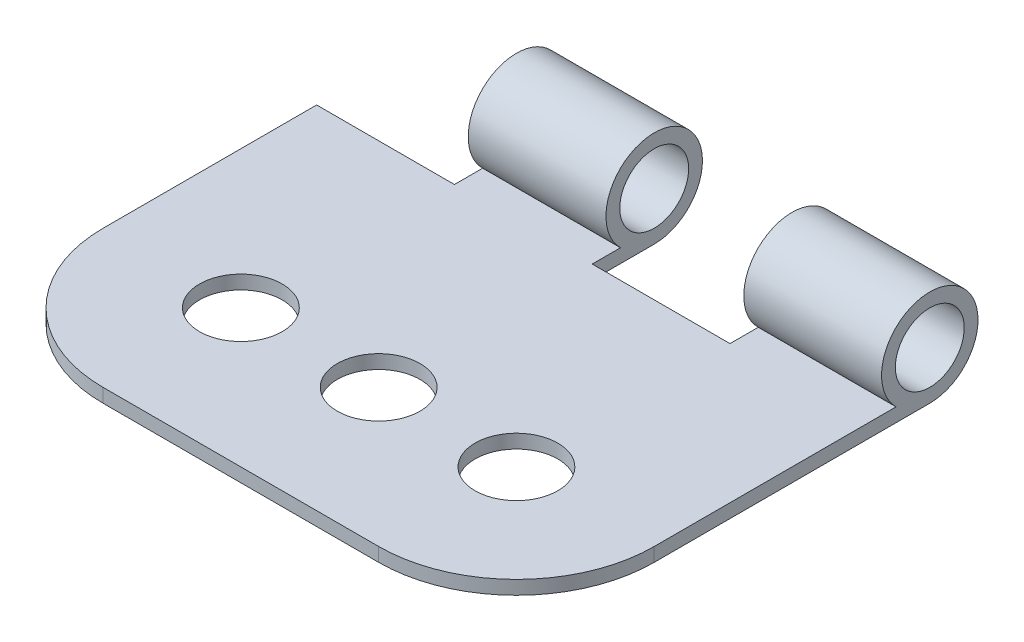
ISO-10303-21;
HEADER;
FILE_DESCRIPTION(('STEP AP214'),'2;1');
FILE_NAME('part.step','',(''),(''),'','','');
FILE_SCHEMA(('AUTOMOTIVE_DESIGN { 1 0 10303 214 1 1 1 1 }'));
ENDSEC;
DATA;
#1=APPLICATION_CONTEXT('core data for automotive mechanical design processes');
#2=APPLICATION_PROTOCOL_DEFINITION('international standard','automotive_design',2000,#1);
#3=PRODUCT_CONTEXT('',#1,'mechanical');
#4=PRODUCT('Part','Part','',(#3));
#5=PRODUCT_RELATED_PRODUCT_CATEGORY('part','',(#4));
#6=PRODUCT_DEFINITION_FORMATION('','',#4);
#7=PRODUCT_DEFINITION_CONTEXT('part definition',#1,'design');
#8=PRODUCT_DEFINITION('design','',#6,#7);
#9=PRODUCT_DEFINITION_SHAPE('','',#8);
#10=(LENGTH_UNIT() NAMED_UNIT(*) SI_UNIT(.MILLI.,.METRE.));
#11=(NAMED_UNIT(*) PLANE_ANGLE_UNIT() SI_UNIT($,.RADIAN.));
#12=(NAMED_UNIT(*) SI_UNIT($,.STERADIAN.) SOLID_ANGLE_UNIT());
#13=UNCERTAINTY_MEASURE_WITH_UNIT(LENGTH_MEASURE(1.E-05),#10,'distance_accuracy_value','');
#14=(GEOMETRIC_REPRESENTATION_CONTEXT(3) GLOBAL_UNCERTAINTY_ASSIGNED_CONTEXT((#13)) GLOBAL_UNIT_ASSIGNED_CONTEXT((#10,
#11,#12)) REPRESENTATION_CONTEXT('',''));
#15=CARTESIAN_POINT('',(0.,0.,0.));
#16=DIRECTION('',(0.,0.,1.));
#17=DIRECTION('',(1.,0.,0.));
#18=AXIS2_PLACEMENT_3D('',#15,#16,#17);
#19=CARTESIAN_POINT('',(40.,-0.342276542958337,17.6196220545612));
#20=DIRECTION('',(1.,0.,0.));
#21=DIRECTION('',(0.,0.,-1.));
#22=AXIS2_PLACEMENT_3D('',#19,#20,#21);
#23=PLANE('',#22);
#24=CARTESIAN_POINT('',(40.,-0.342276542958337,17.6196220545612));
#25=DIRECTION('',(1.,0.,0.));
#26=DIRECTION('',(0.,0.,-1.));
#27=AXIS2_PLACEMENT_3D('',#24,#25,#26);
#28=CIRCLE('',#27,2.5);
#29=CARTESIAN_POINT('',(40.,-0.342276542958337,15.1196220545612));
#30=VERTEX_POINT('',#29);
#31=EDGE_CURVE('E148',#30,#30,#28,.T.);
#32=ORIENTED_EDGE('',*,*,#31,.F.);
#33=EDGE_LOOP('',(#32));
#34=FACE_BOUND('',#33,.T.);
#35=DIRECTION('',(0.,0.,1.));
#36=VECTOR('',#35,1.);
#37=CARTESIAN_POINT('',(40.,-2.84227654295834,57.6196220545612));
#38=LINE('',#37,#36);
#39=CARTESIAN_POINT('',(40.,-2.84227654295833,20.0691117973444));
#40=VERTEX_POINT('',#39);
#41=CARTESIAN_POINT('',(40.,-2.84227654295834,37.6196220545612));
#42=VERTEX_POINT('',#41);
#43=EDGE_CURVE('E135',#40,#42,#38,.T.);
#44=ORIENTED_EDGE('',*,*,#43,.T.);
#45=DIRECTION('',(0.,1.,0.));
#46=VECTOR('',#45,1.);
#47=CARTESIAN_POINT('',(40.,-3.84227654295834,37.6196220545612));
#48=LINE('',#47,#46);
#49=CARTESIAN_POINT('',(40.,-3.84227654295834,37.6196220545612));
#50=VERTEX_POINT('',#49);
#51=EDGE_CURVE('E48',#50,#42,#48,.T.);
#52=ORIENTED_EDGE('',*,*,#51,.F.);
#53=DIRECTION('',(0.,0.,-1.));
#54=VECTOR('',#53,1.);
#55=CARTESIAN_POINT('',(40.,-3.84227654295834,57.6196220545612));
#56=LINE('',#55,#54);
#57=CARTESIAN_POINT('',(40.,-3.84227654295834,17.6196220545612));
#58=VERTEX_POINT('',#57);
#59=EDGE_CURVE('E132',#50,#58,#56,.T.);
#60=ORIENTED_EDGE('',*,*,#59,.T.);
#61=CARTESIAN_POINT('',(40.,-0.342276542958337,17.6196220545612));
#62=DIRECTION('',(1.,0.,0.));
#63=DIRECTION('',(0.,0.,-1.));
#64=AXIS2_PLACEMENT_3D('',#61,#62,#63);
#65=CIRCLE('',#64,3.5);
#66=EDGE_CURVE('E56',#58,#40,#65,.T.);
#67=ORIENTED_EDGE('',*,*,#66,.T.);
#68=EDGE_LOOP('',(#44,#52,#60,#67));
#69=FACE_BOUND('',#68,.T.);
#70=ADVANCED_FACE('F33',(#34,#69),#23,.T.);
#71=CARTESIAN_POINT('',(0.,-0.342276542958337,17.6196220545612));
#72=DIRECTION('',(1.,0.,0.));
#73=DIRECTION('',(0.,0.,-1.));
#74=AXIS2_PLACEMENT_3D('',#71,#72,#73);
#75=PLANE('',#74);
#76=DIRECTION('',(0.,1.,0.));
#77=VECTOR('',#76,1.);
#78=CARTESIAN_POINT('',(0.,-3.84227654295834,37.6196220545612));
#79=LINE('',#78,#77);
#80=CARTESIAN_POINT('',(0.,-3.84227654295834,37.6196220545612));
#81=VERTEX_POINT('',#80);
#82=CARTESIAN_POINT('',(0.,-2.84227654295834,37.6196220545612));
#83=VERTEX_POINT('',#82);
#84=EDGE_CURVE('E221',#81,#83,#79,.T.);
#85=ORIENTED_EDGE('',*,*,#84,.T.);
#86=DIRECTION('',(0.,0.,1.));
#87=VECTOR('',#86,1.);
#88=CARTESIAN_POINT('',(0.,-2.84227654295834,57.6196220545612));
#89=LINE('',#88,#87);
#90=CARTESIAN_POINT('',(0.,-2.84227654295834,22.1196220545612));
#91=VERTEX_POINT('',#90);
#92=EDGE_CURVE('E141',#91,#83,#89,.T.);
#93=ORIENTED_EDGE('',*,*,#92,.F.);
#94=DIRECTION('',(0.,1.,0.));
#95=VECTOR('',#94,1.);
#96=CARTESIAN_POINT('',(0.,-42.8422765429583,22.1196220545612));
#97=LINE('',#96,#95);
#98=CARTESIAN_POINT('',(0.,-3.84227654295834,22.1196220545612));
#99=VERTEX_POINT('',#98);
#100=EDGE_CURVE('E194',#99,#91,#97,.T.);
#101=ORIENTED_EDGE('',*,*,#100,.F.);
#102=DIRECTION('',(0.,0.,-1.));
#103=VECTOR('',#102,1.);
#104=CARTESIAN_POINT('',(0.,-3.84227654295834,57.6196220545612));
#105=LINE('',#104,#103);
#106=EDGE_CURVE('E145',#81,#99,#105,.T.);
#107=ORIENTED_EDGE('',*,*,#106,.F.);
#108=EDGE_LOOP('',(#85,#93,#101,#107));
#109=FACE_BOUND('',#108,.T.);
#110=ADVANCED_FACE('F280',(#109),#75,.F.);
#111=CARTESIAN_POINT('',(40.,-0.342276542958337,17.6196220545612));
#112=DIRECTION('',(-1.,0.,0.));
#113=DIRECTION('',(0.,0.,1.));
#114=AXIS2_PLACEMENT_3D('',#111,#112,#113);
#115=CYLINDRICAL_SURFACE('',#114,3.5);
#116=CARTESIAN_POINT('',(20.,-0.342276542958337,17.6196220545612));
#117=DIRECTION('',(-1.,0.,0.));
#118=DIRECTION('',(0.,0.,1.));
#119=AXIS2_PLACEMENT_3D('',#116,#117,#118);
#120=CIRCLE('',#119,3.5);
#121=CARTESIAN_POINT('',(20.,-2.84227654295833,20.0691117973444));
#122=VERTEX_POINT('',#121);
#123=CARTESIAN_POINT('',(20.,-3.84227654295834,17.6196220545612));
#124=VERTEX_POINT('',#123);
#125=EDGE_CURVE('E178',#122,#124,#120,.T.);
#126=ORIENTED_EDGE('',*,*,#125,.T.);
#127=DIRECTION('',(-1.,0.,0.));
#128=VECTOR('',#127,1.);
#129=CARTESIAN_POINT('',(40.,-3.84227654295834,17.6196220545612));
#130=LINE('',#129,#128);
#131=CARTESIAN_POINT('',(10.,-3.84227654295834,17.6196220545612));
#132=VERTEX_POINT('',#131);
#133=EDGE_CURVE('E157',#124,#132,#130,.T.);
#134=ORIENTED_EDGE('',*,*,#133,.T.);
#135=CARTESIAN_POINT('',(10.,-0.342276542958337,17.6196220545612));
#136=DIRECTION('',(1.,0.,0.));
#137=DIRECTION('',(0.,0.,-1.));
#138=AXIS2_PLACEMENT_3D('',#135,#136,#137);
#139=CIRCLE('',#138,3.5);
#140=CARTESIAN_POINT('',(10.,-2.84227654295834,20.0691117973444));
#141=VERTEX_POINT('',#140);
#142=EDGE_CURVE('E176',#132,#141,#139,.T.);
#143=ORIENTED_EDGE('',*,*,#142,.T.);
#144=DIRECTION('',(-1.,0.,0.));
#145=VECTOR('',#144,1.);
#146=CARTESIAN_POINT('',(40.,-2.84227654295833,20.0691117973444));
#147=LINE('',#146,#145);
#148=EDGE_CURVE('E152',#122,#141,#147,.T.);
#149=ORIENTED_EDGE('',*,*,#148,.F.);
#150=EDGE_LOOP('',(#126,#134,#143,#149));
#151=FACE_BOUND('',#150,.T.);
#152=ADVANCED_FACE('F302',(#151),#115,.T.);
#153=CARTESIAN_POINT('',(40.,-0.342276542958337,17.6196220545612));
#154=DIRECTION('',(-1.,0.,0.));
#155=DIRECTION('',(0.,0.,1.));
#156=AXIS2_PLACEMENT_3D('',#153,#154,#155);
#157=CYLINDRICAL_SURFACE('',#156,2.5);
#158=CARTESIAN_POINT('',(20.,-0.342276542958337,17.6196220545612));
#159=DIRECTION('',(-1.,0.,0.));
#160=DIRECTION('',(0.,0.,1.));
#161=AXIS2_PLACEMENT_3D('',#158,#159,#160);
#162=CIRCLE('',#161,2.5);
#163=CARTESIAN_POINT('',(20.,-0.342276542958337,20.1196220545612));
#164=VERTEX_POINT('',#163);
#165=EDGE_CURVE('E11',#164,#164,#162,.T.);
#166=ORIENTED_EDGE('',*,*,#165,.F.);
#167=EDGE_LOOP('',(#166));
#168=FACE_BOUND('',#167,.T.);
#169=CARTESIAN_POINT('',(10.,-0.342276542958337,17.6196220545612));
#170=DIRECTION('',(1.,0.,0.));
#171=DIRECTION('',(0.,0.,-1.));
#172=AXIS2_PLACEMENT_3D('',#169,#170,#171);
#173=CIRCLE('',#172,2.5);
#174=CARTESIAN_POINT('',(10.,-0.342276542958337,15.1196220545612));
#175=VERTEX_POINT('',#174);
#176=EDGE_CURVE('E159',#175,#175,#173,.T.);
#177=ORIENTED_EDGE('',*,*,#176,.F.);
#178=EDGE_LOOP('',(#177));
#179=FACE_BOUND('',#178,.T.);
#180=ADVANCED_FACE('F172',(#168,#179),#157,.F.);
#181=CARTESIAN_POINT('',(40.,-3.84227654295834,57.6196220545612));
#182=DIRECTION('',(0.,1.,0.));
#183=DIRECTION('',(0.,0.,1.));
#184=AXIS2_PLACEMENT_3D('',#181,#182,#183);
#185=PLANE('',#184);
#186=CARTESIAN_POINT('',(30.,-3.84227654295834,37.6196220545612));
#187=DIRECTION('',(0.,1.,0.));
#188=DIRECTION('',(0.,0.,1.));
#189=AXIS2_PLACEMENT_3D('',#186,#187,#188);
#190=CIRCLE('',#189,3.);
#191=CARTESIAN_POINT('',(30.,-3.84227654295834,40.6196220545612));
#192=VERTEX_POINT('',#191);
#193=EDGE_CURVE('E247',#192,#192,#190,.T.);
#194=ORIENTED_EDGE('',*,*,#193,.T.);
#195=EDGE_LOOP('',(#194));
#196=FACE_BOUND('',#195,.T.);
#197=CARTESIAN_POINT('',(20.,-3.84227654295834,37.6196220545612));
#198=DIRECTION('',(0.,1.,0.));
#199=DIRECTION('',(0.,0.,1.));
#200=AXIS2_PLACEMENT_3D('',#197,#198,#199);
#201=CIRCLE('',#200,3.);
#202=CARTESIAN_POINT('',(20.,-3.84227654295834,40.6196220545612));
#203=VERTEX_POINT('',#202);
#204=EDGE_CURVE('E241',#203,#203,#201,.T.);
#205=ORIENTED_EDGE('',*,*,#204,.T.);
#206=EDGE_LOOP('',(#205));
#207=FACE_BOUND('',#206,.T.);
#208=CARTESIAN_POINT('',(10.,-3.84227654295834,37.6196220545612));
#209=DIRECTION('',(0.,1.,0.));
#210=DIRECTION('',(0.,0.,1.));
#211=AXIS2_PLACEMENT_3D('',#208,#209,#210);
#212=CIRCLE('',#211,3.);
#213=CARTESIAN_POINT('',(10.,-3.84227654295834,40.6196220545612));
#214=VERTEX_POINT('',#213);
#215=EDGE_CURVE('E234',#214,#214,#212,.T.);
#216=ORIENTED_EDGE('',*,*,#215,.T.);
#217=EDGE_LOOP('',(#216));
#218=FACE_BOUND('',#217,.T.);
#219=DIRECTION('',(-1.,0.,0.));
#220=VECTOR('',#219,1.);
#221=CARTESIAN_POINT('',(10.,-3.84227654295834,47.6196220545612));
#222=LINE('',#221,#220);
#223=CARTESIAN_POINT('',(30.,-3.84227654295834,47.6196220545612));
#224=VERTEX_POINT('',#223);
#225=CARTESIAN_POINT('',(10.,-3.84227654295834,47.6196220545612));
#226=VERTEX_POINT('',#225);
#227=EDGE_CURVE('E129',#224,#226,#222,.T.);
#228=ORIENTED_EDGE('',*,*,#227,.T.);
#229=CARTESIAN_POINT('',(10.,-3.84227654295834,37.6196220545612));
#230=DIRECTION('',(0.,-1.,0.));
#231=DIRECTION('',(0.,0.,1.));
#232=AXIS2_PLACEMENT_3D('',#229,#230,#231);
#233=CIRCLE('',#232,10.);
#234=EDGE_CURVE('E136',#226,#81,#233,.T.);
#235=ORIENTED_EDGE('',*,*,#234,.T.);
#236=ORIENTED_EDGE('',*,*,#106,.T.);
#237=DIRECTION('',(1.,0.,0.));
#238=VECTOR('',#237,1.);
#239=CARTESIAN_POINT('',(40.,-3.84227654295834,22.1196220545612));
#240=LINE('',#239,#238);
#241=CARTESIAN_POINT('',(10.,-3.84227654295834,22.1196220545612));
#242=VERTEX_POINT('',#241);
#243=EDGE_CURVE('E190',#99,#242,#240,.T.);
#244=ORIENTED_EDGE('',*,*,#243,.T.);
#245=DIRECTION('',(0.,0.,-1.));
#246=VECTOR('',#245,1.);
#247=CARTESIAN_POINT('',(10.,-3.84227654295834,57.6196220545612));
#248=LINE('',#247,#246);
#249=EDGE_CURVE('E187',#242,#132,#248,.T.);
#250=ORIENTED_EDGE('',*,*,#249,.T.);
#251=ORIENTED_EDGE('',*,*,#133,.F.);
#252=DIRECTION('',(0.,0.,1.));
#253=VECTOR('',#252,1.);
#254=CARTESIAN_POINT('',(20.,-3.84227654295834,57.6196220545612));
#255=LINE('',#254,#253);
#256=CARTESIAN_POINT('',(20.,-3.84227654295834,22.1196220545612));
#257=VERTEX_POINT('',#256);
#258=EDGE_CURVE('E205',#124,#257,#255,.T.);
#259=ORIENTED_EDGE('',*,*,#258,.T.);
#260=DIRECTION('',(1.,0.,0.));
#261=VECTOR('',#260,1.);
#262=CARTESIAN_POINT('',(40.,-3.84227654295834,22.1196220545612));
#263=LINE('',#262,#261);
#264=CARTESIAN_POINT('',(30.,-3.84227654295834,22.1196220545612));
#265=VERTEX_POINT('',#264);
#266=EDGE_CURVE('E202',#257,#265,#263,.T.);
#267=ORIENTED_EDGE('',*,*,#266,.T.);
#268=DIRECTION('',(0.,0.,-1.));
#269=VECTOR('',#268,1.);
#270=CARTESIAN_POINT('',(30.,-3.84227654295834,57.6196220545612));
#271=LINE('',#270,#269);
#272=CARTESIAN_POINT('',(30.,-3.84227654295834,17.6196220545612));
#273=VERTEX_POINT('',#272);
#274=EDGE_CURVE('E208',#265,#273,#271,.T.);
#275=ORIENTED_EDGE('',*,*,#274,.T.);
#276=EDGE_CURVE('E140',#58,#273,#130,.T.);
#277=ORIENTED_EDGE('',*,*,#276,.F.);
#278=ORIENTED_EDGE('',*,*,#59,.F.);
#279=CARTESIAN_POINT('',(30.,-3.84227654295834,37.6196220545612));
#280=DIRECTION('',(0.,-1.,0.));
#281=DIRECTION('',(0.,0.,1.));
#282=AXIS2_PLACEMENT_3D('',#279,#280,#281);
#283=CIRCLE('',#282,10.);
#284=EDGE_CURVE('E122',#50,#224,#283,.T.);
#285=ORIENTED_EDGE('',*,*,#284,.T.);
#286=EDGE_LOOP('',(#228,#235,#236,#244,#250,#251,#259,#267,#275,#277,#278,#285));
#287=FACE_BOUND('',#286,.T.);
#288=ADVANCED_FACE('F35',(#196,#207,#218,#287),#185,.F.);
#289=ORIENTED_EDGE('',*,*,#276,.T.);
#290=CARTESIAN_POINT('',(30.,-0.342276542958337,17.6196220545612));
#291=DIRECTION('',(1.,0.,0.));
#292=DIRECTION('',(0.,0.,-1.));
#293=AXIS2_PLACEMENT_3D('',#290,#291,#292);
#294=CIRCLE('',#293,3.5);
#295=CARTESIAN_POINT('',(30.,-2.84227654295833,20.0691117973444));
#296=VERTEX_POINT('',#295);
#297=EDGE_CURVE('E182',#273,#296,#294,.T.);
#298=ORIENTED_EDGE('',*,*,#297,.T.);
#299=EDGE_CURVE('E154',#40,#296,#147,.T.);
#300=ORIENTED_EDGE('',*,*,#299,.F.);
#301=ORIENTED_EDGE('',*,*,#66,.F.);
#302=EDGE_LOOP('',(#289,#298,#300,#301));
#303=FACE_BOUND('',#302,.T.);
#304=ADVANCED_FACE('F267',(#303),#115,.T.);
#305=CARTESIAN_POINT('',(40.,-2.84227654295834,57.6196220545612));
#306=DIRECTION('',(0.,-1.,0.));
#307=DIRECTION('',(0.,0.,-1.));
#308=AXIS2_PLACEMENT_3D('',#305,#306,#307);
#309=PLANE('',#308);
#310=CARTESIAN_POINT('',(30.,-2.84227654295834,37.6196220545612));
#311=DIRECTION('',(0.,1.,0.));
#312=DIRECTION('',(0.,0.,1.));
#313=AXIS2_PLACEMENT_3D('',#310,#311,#312);
#314=CIRCLE('',#313,3.);
#315=CARTESIAN_POINT('',(30.,-2.84227654295834,40.6196220545612));
#316=VERTEX_POINT('',#315);
#317=EDGE_CURVE('E250',#316,#316,#314,.T.);
#318=ORIENTED_EDGE('',*,*,#317,.F.);
#319=EDGE_LOOP('',(#318));
#320=FACE_BOUND('',#319,.T.);
#321=CARTESIAN_POINT('',(20.,-2.84227654295834,37.6196220545612));
#322=DIRECTION('',(0.,1.,0.));
#323=DIRECTION('',(0.,0.,1.));
#324=AXIS2_PLACEMENT_3D('',#321,#322,#323);
#325=CIRCLE('',#324,3.);
#326=CARTESIAN_POINT('',(20.,-2.84227654295834,40.6196220545612));
#327=VERTEX_POINT('',#326);
#328=EDGE_CURVE('E244',#327,#327,#325,.T.);
#329=ORIENTED_EDGE('',*,*,#328,.F.);
#330=EDGE_LOOP('',(#329));
#331=FACE_BOUND('',#330,.T.);
#332=CARTESIAN_POINT('',(10.,-2.84227654295834,37.6196220545612));
#333=DIRECTION('',(0.,1.,0.));
#334=DIRECTION('',(0.,0.,1.));
#335=AXIS2_PLACEMENT_3D('',#332,#333,#334);
#336=CIRCLE('',#335,3.);
#337=CARTESIAN_POINT('',(10.,-2.84227654295834,40.6196220545612));
#338=VERTEX_POINT('',#337);
#339=EDGE_CURVE('E238',#338,#338,#336,.T.);
#340=ORIENTED_EDGE('',*,*,#339,.F.);
#341=EDGE_LOOP('',(#340));
#342=FACE_BOUND('',#341,.T.);
#343=ORIENTED_EDGE('',*,*,#92,.T.);
#344=CARTESIAN_POINT('',(10.,-2.84227654295834,37.6196220545612));
#345=DIRECTION('',(0.,-1.,0.));
#346=DIRECTION('',(0.,0.,1.));
#347=AXIS2_PLACEMENT_3D('',#344,#345,#346);
#348=CIRCLE('',#347,10.);
#349=CARTESIAN_POINT('',(10.,-2.84227654295834,47.6196220545612));
#350=VERTEX_POINT('',#349);
#351=EDGE_CURVE('E130',#350,#83,#348,.T.);
#352=ORIENTED_EDGE('',*,*,#351,.F.);
#353=DIRECTION('',(-1.,0.,0.));
#354=VECTOR('',#353,1.);
#355=CARTESIAN_POINT('',(10.,-2.84227654295834,47.6196220545612));
#356=LINE('',#355,#354);
#357=CARTESIAN_POINT('',(30.,-2.84227654295834,47.6196220545612));
#358=VERTEX_POINT('',#357);
#359=EDGE_CURVE('E229',#358,#350,#356,.T.);
#360=ORIENTED_EDGE('',*,*,#359,.F.);
#361=CARTESIAN_POINT('',(30.,-2.84227654295834,37.6196220545612));
#362=DIRECTION('',(0.,-1.,0.));
#363=DIRECTION('',(0.,0.,1.));
#364=AXIS2_PLACEMENT_3D('',#361,#362,#363);
#365=CIRCLE('',#364,10.);
#366=EDGE_CURVE('E232',#42,#358,#365,.T.);
#367=ORIENTED_EDGE('',*,*,#366,.F.);
#368=ORIENTED_EDGE('',*,*,#43,.F.);
#369=ORIENTED_EDGE('',*,*,#299,.T.);
#370=DIRECTION('',(0.,0.,-1.));
#371=VECTOR('',#370,1.);
#372=CARTESIAN_POINT('',(30.,-2.84227654295834,22.1196220545612));
#373=LINE('',#372,#371);
#374=CARTESIAN_POINT('',(30.,-2.84227654295834,22.1196220545612));
#375=VERTEX_POINT('',#374);
#376=EDGE_CURVE('E217',#375,#296,#373,.T.);
#377=ORIENTED_EDGE('',*,*,#376,.F.);
#378=DIRECTION('',(1.,0.,0.));
#379=VECTOR('',#378,1.);
#380=CARTESIAN_POINT('',(30.,-2.84227654295834,22.1196220545612));
#381=LINE('',#380,#379);
#382=CARTESIAN_POINT('',(20.,-2.84227654295834,22.1196220545612));
#383=VERTEX_POINT('',#382);
#384=EDGE_CURVE('E219',#383,#375,#381,.T.);
#385=ORIENTED_EDGE('',*,*,#384,.F.);
#386=DIRECTION('',(0.,0.,1.));
#387=VECTOR('',#386,1.);
#388=CARTESIAN_POINT('',(20.,-2.84227654295834,22.1196220545612));
#389=LINE('',#388,#387);
#390=EDGE_CURVE('E213',#122,#383,#389,.T.);
#391=ORIENTED_EDGE('',*,*,#390,.F.);
#392=ORIENTED_EDGE('',*,*,#148,.T.);
#393=DIRECTION('',(0.,0.,-1.));
#394=VECTOR('',#393,1.);
#395=CARTESIAN_POINT('',(10.,-2.84227654295834,22.1196220545612));
#396=LINE('',#395,#394);
#397=CARTESIAN_POINT('',(10.,-2.84227654295834,22.1196220545612));
#398=VERTEX_POINT('',#397);
#399=EDGE_CURVE('E200',#398,#141,#396,.T.);
#400=ORIENTED_EDGE('',*,*,#399,.F.);
#401=DIRECTION('',(1.,0.,0.));
#402=VECTOR('',#401,1.);
#403=CARTESIAN_POINT('',(10.,-2.84227654295834,22.1196220545612));
#404=LINE('',#403,#402);
#405=EDGE_CURVE('E196',#91,#398,#404,.T.);
#406=ORIENTED_EDGE('',*,*,#405,.F.);
#407=EDGE_LOOP('',(#343,#352,#360,#367,#368,#369,#377,#385,#391,#392,#400,#406));
#408=FACE_BOUND('',#407,.T.);
#409=ADVANCED_FACE('F170',(#320,#331,#342,#408),#309,.F.);
#410=CARTESIAN_POINT('',(30.,-0.342276542958337,17.6196220545612));
#411=DIRECTION('',(1.,0.,0.));
#412=DIRECTION('',(0.,0.,-1.));
#413=AXIS2_PLACEMENT_3D('',#410,#411,#412);
#414=CIRCLE('',#413,2.5);
#415=CARTESIAN_POINT('',(30.,-0.342276542958337,15.1196220545612));
#416=VERTEX_POINT('',#415);
#417=EDGE_CURVE('E41',#416,#416,#414,.T.);
#418=ORIENTED_EDGE('',*,*,#417,.F.);
#419=EDGE_LOOP('',(#418));
#420=FACE_BOUND('',#419,.T.);
#421=ORIENTED_EDGE('',*,*,#31,.T.);
#422=EDGE_LOOP('',(#421));
#423=FACE_BOUND('',#422,.T.);
#424=ADVANCED_FACE('F166',(#420,#423),#157,.F.);
#425=CARTESIAN_POINT('',(10.,-2.84227654295834,14.1196220545612));
#426=DIRECTION('',(1.,0.,0.));
#427=DIRECTION('',(0.,0.,-1.));
#428=AXIS2_PLACEMENT_3D('',#425,#426,#427);
#429=PLANE('',#428);
#430=ORIENTED_EDGE('',*,*,#176,.T.);
#431=EDGE_LOOP('',(#430));
#432=FACE_BOUND('',#431,.T.);
#433=ORIENTED_EDGE('',*,*,#142,.F.);
#434=ORIENTED_EDGE('',*,*,#249,.F.);
#435=DIRECTION('',(0.,1.,0.));
#436=VECTOR('',#435,1.);
#437=CARTESIAN_POINT('',(10.,-42.8422765429583,22.1196220545612));
#438=LINE('',#437,#436);
#439=EDGE_CURVE('E193',#242,#398,#438,.T.);
#440=ORIENTED_EDGE('',*,*,#439,.T.);
#441=ORIENTED_EDGE('',*,*,#399,.T.);
#442=EDGE_LOOP('',(#433,#434,#440,#441));
#443=FACE_BOUND('',#442,.T.);
#444=ADVANCED_FACE('F169',(#432,#443),#429,.F.);
#445=CARTESIAN_POINT('',(20.,-2.84227654295834,14.1196220545612));
#446=DIRECTION('',(-1.,0.,0.));
#447=DIRECTION('',(0.,0.,1.));
#448=AXIS2_PLACEMENT_3D('',#445,#446,#447);
#449=PLANE('',#448);
#450=ORIENTED_EDGE('',*,*,#165,.T.);
#451=EDGE_LOOP('',(#450));
#452=FACE_BOUND('',#451,.T.);
#453=ORIENTED_EDGE('',*,*,#125,.F.);
#454=ORIENTED_EDGE('',*,*,#390,.T.);
#455=DIRECTION('',(0.,1.,0.));
#456=VECTOR('',#455,1.);
#457=CARTESIAN_POINT('',(20.,-42.8422765429583,22.1196220545612));
#458=LINE('',#457,#456);
#459=EDGE_CURVE('E210',#257,#383,#458,.T.);
#460=ORIENTED_EDGE('',*,*,#459,.F.);
#461=ORIENTED_EDGE('',*,*,#258,.F.);
#462=EDGE_LOOP('',(#453,#454,#460,#461));
#463=FACE_BOUND('',#462,.T.);
#464=ADVANCED_FACE('F300',(#452,#463),#449,.F.);
#465=CARTESIAN_POINT('',(30.,-2.84227654295834,14.1196220545612));
#466=DIRECTION('',(1.,0.,0.));
#467=DIRECTION('',(0.,0.,-1.));
#468=AXIS2_PLACEMENT_3D('',#465,#466,#467);
#469=PLANE('',#468);
#470=ORIENTED_EDGE('',*,*,#376,.T.);
#471=ORIENTED_EDGE('',*,*,#297,.F.);
#472=ORIENTED_EDGE('',*,*,#274,.F.);
#473=DIRECTION('',(0.,1.,0.));
#474=VECTOR('',#473,1.);
#475=CARTESIAN_POINT('',(30.,-42.8422765429583,22.1196220545612));
#476=LINE('',#475,#474);
#477=EDGE_CURVE('E211',#265,#375,#476,.T.);
#478=ORIENTED_EDGE('',*,*,#477,.T.);
#479=EDGE_LOOP('',(#470,#471,#472,#478));
#480=FACE_BOUND('',#479,.T.);
#481=ORIENTED_EDGE('',*,*,#417,.T.);
#482=EDGE_LOOP('',(#481));
#483=FACE_BOUND('',#482,.T.);
#484=ADVANCED_FACE('F164',(#480,#483),#469,.F.);
#485=CARTESIAN_POINT('',(10.,-42.8422765429583,22.1196220545612));
#486=DIRECTION('',(0.,0.,1.));
#487=DIRECTION('',(0.,-1.,0.));
#488=AXIS2_PLACEMENT_3D('',#485,#486,#487);
#489=PLANE('',#488);
#490=ORIENTED_EDGE('',*,*,#100,.T.);
#491=ORIENTED_EDGE('',*,*,#405,.T.);
#492=ORIENTED_EDGE('',*,*,#439,.F.);
#493=ORIENTED_EDGE('',*,*,#243,.F.);
#494=EDGE_LOOP('',(#490,#491,#492,#493));
#495=FACE_BOUND('',#494,.T.);
#496=ADVANCED_FACE('F306',(#495),#489,.F.);
#497=CARTESIAN_POINT('',(30.,-42.8422765429583,22.1196220545612));
#498=DIRECTION('',(0.,0.,1.));
#499=DIRECTION('',(0.,-1.,0.));
#500=AXIS2_PLACEMENT_3D('',#497,#498,#499);
#501=PLANE('',#500);
#502=ORIENTED_EDGE('',*,*,#459,.T.);
#503=ORIENTED_EDGE('',*,*,#384,.T.);
#504=ORIENTED_EDGE('',*,*,#477,.F.);
#505=ORIENTED_EDGE('',*,*,#266,.F.);
#506=EDGE_LOOP('',(#502,#503,#504,#505));
#507=FACE_BOUND('',#506,.T.);
#508=ADVANCED_FACE('F297',(#507),#501,.F.);
#509=CARTESIAN_POINT('',(10.,-3.84227654295834,37.6196220545612));
#510=DIRECTION('',(0.,1.,0.));
#511=DIRECTION('',(0.,0.,1.));
#512=AXIS2_PLACEMENT_3D('',#509,#510,#511);
#513=CYLINDRICAL_SURFACE('',#512,10.);
#514=ORIENTED_EDGE('',*,*,#351,.T.);
#515=ORIENTED_EDGE('',*,*,#84,.F.);
#516=ORIENTED_EDGE('',*,*,#234,.F.);
#517=DIRECTION('',(0.,1.,0.));
#518=VECTOR('',#517,1.);
#519=CARTESIAN_POINT('',(10.,-3.84227654295834,47.6196220545612));
#520=LINE('',#519,#518);
#521=EDGE_CURVE('E224',#226,#350,#520,.T.);
#522=ORIENTED_EDGE('',*,*,#521,.T.);
#523=EDGE_LOOP('',(#514,#515,#516,#522));
#524=FACE_BOUND('',#523,.T.);
#525=ADVANCED_FACE('F284',(#524),#513,.T.);
#526=CARTESIAN_POINT('',(10.,-3.84227654295834,47.6196220545612));
#527=DIRECTION('',(0.,0.,-1.));
#528=DIRECTION('',(0.,1.,0.));
#529=AXIS2_PLACEMENT_3D('',#526,#527,#528);
#530=PLANE('',#529);
#531=ORIENTED_EDGE('',*,*,#359,.T.);
#532=ORIENTED_EDGE('',*,*,#521,.F.);
#533=ORIENTED_EDGE('',*,*,#227,.F.);
#534=DIRECTION('',(0.,1.,0.));
#535=VECTOR('',#534,1.);
#536=CARTESIAN_POINT('',(30.,-3.84227654295834,47.6196220545612));
#537=LINE('',#536,#535);
#538=EDGE_CURVE('E124',#224,#358,#537,.T.);
#539=ORIENTED_EDGE('',*,*,#538,.T.);
#540=EDGE_LOOP('',(#531,#532,#533,#539));
#541=FACE_BOUND('',#540,.T.);
#542=ADVANCED_FACE('F287',(#541),#530,.F.);
#543=CARTESIAN_POINT('',(30.,-3.84227654295834,37.6196220545612));
#544=DIRECTION('',(0.,1.,0.));
#545=DIRECTION('',(0.,0.,1.));
#546=AXIS2_PLACEMENT_3D('',#543,#544,#545);
#547=CYLINDRICAL_SURFACE('',#546,10.);
#548=ORIENTED_EDGE('',*,*,#366,.T.);
#549=ORIENTED_EDGE('',*,*,#538,.F.);
#550=ORIENTED_EDGE('',*,*,#284,.F.);
#551=ORIENTED_EDGE('',*,*,#51,.T.);
#552=EDGE_LOOP('',(#548,#549,#550,#551));
#553=FACE_BOUND('',#552,.T.);
#554=ADVANCED_FACE('F123',(#553),#547,.T.);
#555=CARTESIAN_POINT('',(10.,-3.84227654295834,37.6196220545612));
#556=DIRECTION('',(0.,1.,0.));
#557=DIRECTION('',(0.,0.,1.));
#558=AXIS2_PLACEMENT_3D('',#555,#556,#557);
#559=CYLINDRICAL_SURFACE('',#558,3.);
#560=ORIENTED_EDGE('',*,*,#215,.F.);
#561=EDGE_LOOP('',(#560));
#562=FACE_BOUND('',#561,.T.);
#563=ORIENTED_EDGE('',*,*,#339,.T.);
#564=EDGE_LOOP('',(#563));
#565=FACE_BOUND('',#564,.T.);
#566=ADVANCED_FACE('F410',(#562,#565),#559,.F.);
#567=CARTESIAN_POINT('',(20.,-3.84227654295834,37.6196220545612));
#568=DIRECTION('',(0.,1.,0.));
#569=DIRECTION('',(0.,0.,1.));
#570=AXIS2_PLACEMENT_3D('',#567,#568,#569);
#571=CYLINDRICAL_SURFACE('',#570,3.);
#572=ORIENTED_EDGE('',*,*,#204,.F.);
#573=EDGE_LOOP('',(#572));
#574=FACE_BOUND('',#573,.T.);
#575=ORIENTED_EDGE('',*,*,#328,.T.);
#576=EDGE_LOOP('',(#575));
#577=FACE_BOUND('',#576,.T.);
#578=ADVANCED_FACE('F261',(#574,#577),#571,.F.);
#579=CARTESIAN_POINT('',(30.,-3.84227654295834,37.6196220545612));
#580=DIRECTION('',(0.,1.,0.));
#581=DIRECTION('',(0.,0.,1.));
#582=AXIS2_PLACEMENT_3D('',#579,#580,#581);
#583=CYLINDRICAL_SURFACE('',#582,3.);
#584=ORIENTED_EDGE('',*,*,#193,.F.);
#585=EDGE_LOOP('',(#584));
#586=FACE_BOUND('',#585,.T.);
#587=ORIENTED_EDGE('',*,*,#317,.T.);
#588=EDGE_LOOP('',(#587));
#589=FACE_BOUND('',#588,.T.);
#590=ADVANCED_FACE('F258',(#586,#589),#583,.F.);
#591=CLOSED_SHELL('',(#70,#110,#152,#180,#288,#304,#409,#424,#444,#464,#484,#496,#508,#525,#542,
#554,#566,#578,#590));
#592=MANIFOLD_SOLID_BREP('B2',#591);
#593=ADVANCED_BREP_SHAPE_REPRESENTATION('',(#18,#592),#14);
#594=SHAPE_DEFINITION_REPRESENTATION(#9,#593);
ENDSEC;
END-ISO-10303-21;
